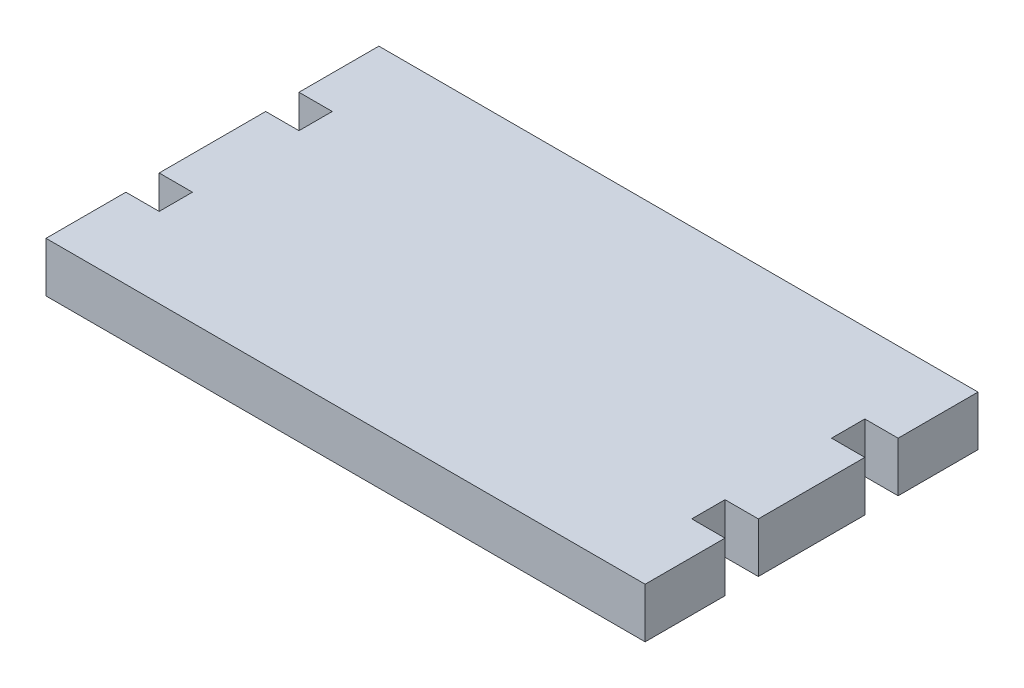
ISO-10303-21;
HEADER;
FILE_DESCRIPTION(('STEP AP214'),'2;1');
FILE_NAME('part.step','',(''),(''),'','','');
FILE_SCHEMA(('AUTOMOTIVE_DESIGN { 1 0 10303 214 1 1 1 1 }'));
ENDSEC;
DATA;
#1=APPLICATION_CONTEXT('core data for automotive mechanical design processes');
#2=APPLICATION_PROTOCOL_DEFINITION('international standard','automotive_design',2000,#1);
#3=PRODUCT_CONTEXT('',#1,'mechanical');
#4=PRODUCT('Part','Part','',(#3));
#5=PRODUCT_RELATED_PRODUCT_CATEGORY('part','',(#4));
#6=PRODUCT_DEFINITION_FORMATION('','',#4);
#7=PRODUCT_DEFINITION_CONTEXT('part definition',#1,'design');
#8=PRODUCT_DEFINITION('design','',#6,#7);
#9=PRODUCT_DEFINITION_SHAPE('','',#8);
#10=(LENGTH_UNIT() NAMED_UNIT(*) SI_UNIT(.MILLI.,.METRE.));
#11=(NAMED_UNIT(*) PLANE_ANGLE_UNIT() SI_UNIT($,.RADIAN.));
#12=(NAMED_UNIT(*) SI_UNIT($,.STERADIAN.) SOLID_ANGLE_UNIT());
#13=UNCERTAINTY_MEASURE_WITH_UNIT(LENGTH_MEASURE(1.E-05),#10,'distance_accuracy_value','');
#14=(GEOMETRIC_REPRESENTATION_CONTEXT(3) GLOBAL_UNCERTAINTY_ASSIGNED_CONTEXT((#13)) GLOBAL_UNIT_ASSIGNED_CONTEXT((#10,
#11,#12)) REPRESENTATION_CONTEXT('',''));
#15=CARTESIAN_POINT('',(0.,0.,0.));
#16=DIRECTION('',(0.,0.,1.));
#17=DIRECTION('',(1.,0.,0.));
#18=AXIS2_PLACEMENT_3D('',#15,#16,#17);
#19=CARTESIAN_POINT('',(0.,4.7625,0.));
#20=DIRECTION('',(-1.,0.,0.));
#21=DIRECTION('',(0.,0.,1.));
#22=AXIS2_PLACEMENT_3D('',#19,#20,#21);
#23=PLANE('',#22);
#24=DIRECTION('',(0.,0.,-1.));
#25=VECTOR('',#24,1.);
#26=CARTESIAN_POINT('',(0.,0.,0.));
#27=LINE('',#26,#25);
#28=CARTESIAN_POINT('',(0.,0.,-24.13));
#29=VERTEX_POINT('',#28);
#30=CARTESIAN_POINT('',(0.,0.,-31.75));
#31=VERTEX_POINT('',#30);
#32=EDGE_CURVE('E210',#29,#31,#27,.T.);
#33=ORIENTED_EDGE('',*,*,#32,.F.);
#34=DIRECTION('',(0.,-1.,0.));
#35=VECTOR('',#34,1.);
#36=CARTESIAN_POINT('',(0.,4.7625,-24.13));
#37=LINE('',#36,#35);
#38=CARTESIAN_POINT('',(0.,4.7625,-24.13));
#39=VERTEX_POINT('',#38);
#40=EDGE_CURVE('E11',#39,#29,#37,.T.);
#41=ORIENTED_EDGE('',*,*,#40,.F.);
#42=DIRECTION('',(0.,0.,-1.));
#43=VECTOR('',#42,1.);
#44=CARTESIAN_POINT('',(0.,4.7625,0.));
#45=LINE('',#44,#43);
#46=CARTESIAN_POINT('',(0.,4.7625,-31.75));
#47=VERTEX_POINT('',#46);
#48=EDGE_CURVE('E278',#39,#47,#45,.T.);
#49=ORIENTED_EDGE('',*,*,#48,.T.);
#50=DIRECTION('',(0.,-1.,0.));
#51=VECTOR('',#50,1.);
#52=CARTESIAN_POINT('',(0.,4.7625,-31.75));
#53=LINE('',#52,#51);
#54=EDGE_CURVE('E56',#47,#31,#53,.T.);
#55=ORIENTED_EDGE('',*,*,#54,.T.);
#56=EDGE_LOOP('',(#33,#41,#49,#55));
#57=FACE_BOUND('',#56,.T.);
#58=ADVANCED_FACE('F39',(#57),#23,.T.);
#59=CARTESIAN_POINT('',(0.,4.7625,-24.13));
#60=DIRECTION('',(0.,0.,-1.));
#61=DIRECTION('',(-1.,0.,0.));
#62=AXIS2_PLACEMENT_3D('',#59,#60,#61);
#63=PLANE('',#62);
#64=DIRECTION('',(1.,0.,0.));
#65=VECTOR('',#64,1.);
#66=CARTESIAN_POINT('',(0.,0.,-24.13));
#67=LINE('',#66,#65);
#68=CARTESIAN_POINT('',(3.175,0.,-24.13));
#69=VERTEX_POINT('',#68);
#70=EDGE_CURVE('E213',#29,#69,#67,.T.);
#71=ORIENTED_EDGE('',*,*,#70,.T.);
#72=DIRECTION('',(0.,-1.,0.));
#73=VECTOR('',#72,1.);
#74=CARTESIAN_POINT('',(3.175,4.7625,-24.13));
#75=LINE('',#74,#73);
#76=CARTESIAN_POINT('',(3.175,4.7625,-24.13));
#77=VERTEX_POINT('',#76);
#78=EDGE_CURVE('E48',#77,#69,#75,.T.);
#79=ORIENTED_EDGE('',*,*,#78,.F.);
#80=DIRECTION('',(1.,0.,0.));
#81=VECTOR('',#80,1.);
#82=CARTESIAN_POINT('',(0.,4.7625,-24.13));
#83=LINE('',#82,#81);
#84=EDGE_CURVE('E633',#39,#77,#83,.T.);
#85=ORIENTED_EDGE('',*,*,#84,.F.);
#86=ORIENTED_EDGE('',*,*,#40,.T.);
#87=EDGE_LOOP('',(#71,#79,#85,#86));
#88=FACE_BOUND('',#87,.T.);
#89=ADVANCED_FACE('F418',(#88),#63,.F.);
#90=CARTESIAN_POINT('',(3.17500000000003,4.7625,0.));
#91=DIRECTION('',(1.,0.,0.));
#92=DIRECTION('',(0.,0.,-1.));
#93=AXIS2_PLACEMENT_3D('',#90,#91,#92);
#94=PLANE('',#93);
#95=DIRECTION('',(0.,0.,1.));
#96=VECTOR('',#95,1.);
#97=CARTESIAN_POINT('',(3.17500000000003,0.,0.));
#98=LINE('',#97,#96);
#99=CARTESIAN_POINT('',(3.175,0.,-20.955));
#100=VERTEX_POINT('',#99);
#101=EDGE_CURVE('E216',#69,#100,#98,.T.);
#102=ORIENTED_EDGE('',*,*,#101,.T.);
#103=DIRECTION('',(0.,-1.,0.));
#104=VECTOR('',#103,1.);
#105=CARTESIAN_POINT('',(3.175,4.7625,-20.955));
#106=LINE('',#105,#104);
#107=CARTESIAN_POINT('',(3.175,4.7625,-20.955));
#108=VERTEX_POINT('',#107);
#109=EDGE_CURVE('E330',#108,#100,#106,.T.);
#110=ORIENTED_EDGE('',*,*,#109,.F.);
#111=DIRECTION('',(0.,0.,1.));
#112=VECTOR('',#111,1.);
#113=CARTESIAN_POINT('',(3.17500000000003,4.7625,0.));
#114=LINE('',#113,#112);
#115=EDGE_CURVE('E341',#77,#108,#114,.T.);
#116=ORIENTED_EDGE('',*,*,#115,.F.);
#117=ORIENTED_EDGE('',*,*,#78,.T.);
#118=EDGE_LOOP('',(#102,#110,#116,#117));
#119=FACE_BOUND('',#118,.T.);
#120=ADVANCED_FACE('F339',(#119),#94,.F.);
#121=CARTESIAN_POINT('',(0.,4.7625,-20.955));
#122=DIRECTION('',(0.,0.,1.));
#123=DIRECTION('',(1.,0.,0.));
#124=AXIS2_PLACEMENT_3D('',#121,#122,#123);
#125=PLANE('',#124);
#126=DIRECTION('',(-1.,0.,0.));
#127=VECTOR('',#126,1.);
#128=CARTESIAN_POINT('',(0.,0.,-20.955));
#129=LINE('',#128,#127);
#130=CARTESIAN_POINT('',(0.,0.,-20.955));
#131=VERTEX_POINT('',#130);
#132=EDGE_CURVE('E219',#100,#131,#129,.T.);
#133=ORIENTED_EDGE('',*,*,#132,.T.);
#134=DIRECTION('',(0.,-1.,0.));
#135=VECTOR('',#134,1.);
#136=CARTESIAN_POINT('',(0.,4.7625,-20.955));
#137=LINE('',#136,#135);
#138=CARTESIAN_POINT('',(0.,4.7625,-20.955));
#139=VERTEX_POINT('',#138);
#140=EDGE_CURVE('E326',#139,#131,#137,.T.);
#141=ORIENTED_EDGE('',*,*,#140,.F.);
#142=DIRECTION('',(-1.,0.,0.));
#143=VECTOR('',#142,1.);
#144=CARTESIAN_POINT('',(0.,4.7625,-20.955));
#145=LINE('',#144,#143);
#146=EDGE_CURVE('E361',#108,#139,#145,.T.);
#147=ORIENTED_EDGE('',*,*,#146,.F.);
#148=ORIENTED_EDGE('',*,*,#109,.T.);
#149=EDGE_LOOP('',(#133,#141,#147,#148));
#150=FACE_BOUND('',#149,.T.);
#151=ADVANCED_FACE('F351',(#150),#125,.F.);
#152=CARTESIAN_POINT('',(0.,4.7625,0.));
#153=DIRECTION('',(1.,0.,0.));
#154=DIRECTION('',(0.,0.,-1.));
#155=AXIS2_PLACEMENT_3D('',#152,#153,#154);
#156=PLANE('',#155);
#157=DIRECTION('',(0.,0.,1.));
#158=VECTOR('',#157,1.);
#159=CARTESIAN_POINT('',(0.,0.,0.));
#160=LINE('',#159,#158);
#161=CARTESIAN_POINT('',(0.,0.,-10.795));
#162=VERTEX_POINT('',#161);
#163=EDGE_CURVE('E222',#131,#162,#160,.T.);
#164=ORIENTED_EDGE('',*,*,#163,.T.);
#165=DIRECTION('',(0.,-1.,0.));
#166=VECTOR('',#165,1.);
#167=CARTESIAN_POINT('',(0.,4.7625,-10.795));
#168=LINE('',#167,#166);
#169=CARTESIAN_POINT('',(0.,4.7625,-10.795));
#170=VERTEX_POINT('',#169);
#171=EDGE_CURVE('E322',#170,#162,#168,.T.);
#172=ORIENTED_EDGE('',*,*,#171,.F.);
#173=DIRECTION('',(0.,0.,1.));
#174=VECTOR('',#173,1.);
#175=CARTESIAN_POINT('',(0.,4.7625,0.));
#176=LINE('',#175,#174);
#177=EDGE_CURVE('E357',#139,#170,#176,.T.);
#178=ORIENTED_EDGE('',*,*,#177,.F.);
#179=ORIENTED_EDGE('',*,*,#140,.T.);
#180=EDGE_LOOP('',(#164,#172,#178,#179));
#181=FACE_BOUND('',#180,.T.);
#182=ADVANCED_FACE('F355',(#181),#156,.F.);
#183=CARTESIAN_POINT('',(0.,4.7625,-10.795));
#184=DIRECTION('',(0.,0.,-1.));
#185=DIRECTION('',(-1.,0.,0.));
#186=AXIS2_PLACEMENT_3D('',#183,#184,#185);
#187=PLANE('',#186);
#188=DIRECTION('',(1.,0.,0.));
#189=VECTOR('',#188,1.);
#190=CARTESIAN_POINT('',(0.,0.,-10.795));
#191=LINE('',#190,#189);
#192=CARTESIAN_POINT('',(3.175,0.,-10.795));
#193=VERTEX_POINT('',#192);
#194=EDGE_CURVE('E225',#162,#193,#191,.T.);
#195=ORIENTED_EDGE('',*,*,#194,.T.);
#196=DIRECTION('',(0.,-1.,0.));
#197=VECTOR('',#196,1.);
#198=CARTESIAN_POINT('',(3.175,4.7625,-10.795));
#199=LINE('',#198,#197);
#200=CARTESIAN_POINT('',(3.175,4.7625,-10.795));
#201=VERTEX_POINT('',#200);
#202=EDGE_CURVE('E318',#201,#193,#199,.T.);
#203=ORIENTED_EDGE('',*,*,#202,.F.);
#204=DIRECTION('',(1.,0.,0.));
#205=VECTOR('',#204,1.);
#206=CARTESIAN_POINT('',(0.,4.7625,-10.795));
#207=LINE('',#206,#205);
#208=EDGE_CURVE('E360',#170,#201,#207,.T.);
#209=ORIENTED_EDGE('',*,*,#208,.F.);
#210=ORIENTED_EDGE('',*,*,#171,.T.);
#211=EDGE_LOOP('',(#195,#203,#209,#210));
#212=FACE_BOUND('',#211,.T.);
#213=ADVANCED_FACE('F431',(#212),#187,.F.);
#214=CARTESIAN_POINT('',(3.17499999999998,4.7625,0.));
#215=DIRECTION('',(1.,0.,0.));
#216=DIRECTION('',(0.,0.,-1.));
#217=AXIS2_PLACEMENT_3D('',#214,#215,#216);
#218=PLANE('',#217);
#219=DIRECTION('',(0.,0.,1.));
#220=VECTOR('',#219,1.);
#221=CARTESIAN_POINT('',(3.17499999999998,0.,0.));
#222=LINE('',#221,#220);
#223=CARTESIAN_POINT('',(3.175,0.,-7.62));
#224=VERTEX_POINT('',#223);
#225=EDGE_CURVE('E228',#193,#224,#222,.T.);
#226=ORIENTED_EDGE('',*,*,#225,.T.);
#227=DIRECTION('',(0.,-1.,0.));
#228=VECTOR('',#227,1.);
#229=CARTESIAN_POINT('',(3.175,4.7625,-7.62));
#230=LINE('',#229,#228);
#231=CARTESIAN_POINT('',(3.175,4.7625,-7.62));
#232=VERTEX_POINT('',#231);
#233=EDGE_CURVE('E314',#232,#224,#230,.T.);
#234=ORIENTED_EDGE('',*,*,#233,.F.);
#235=DIRECTION('',(0.,0.,1.));
#236=VECTOR('',#235,1.);
#237=CARTESIAN_POINT('',(3.17499999999998,4.7625,0.));
#238=LINE('',#237,#236);
#239=EDGE_CURVE('E365',#201,#232,#238,.T.);
#240=ORIENTED_EDGE('',*,*,#239,.F.);
#241=ORIENTED_EDGE('',*,*,#202,.T.);
#242=EDGE_LOOP('',(#226,#234,#240,#241));
#243=FACE_BOUND('',#242,.T.);
#244=ADVANCED_FACE('F434',(#243),#218,.F.);
#245=CARTESIAN_POINT('',(0.,4.7625,-7.62));
#246=DIRECTION('',(0.,0.,1.));
#247=DIRECTION('',(1.,0.,0.));
#248=AXIS2_PLACEMENT_3D('',#245,#246,#247);
#249=PLANE('',#248);
#250=DIRECTION('',(-1.,0.,0.));
#251=VECTOR('',#250,1.);
#252=CARTESIAN_POINT('',(0.,0.,-7.62));
#253=LINE('',#252,#251);
#254=CARTESIAN_POINT('',(0.,0.,-7.62));
#255=VERTEX_POINT('',#254);
#256=EDGE_CURVE('E231',#224,#255,#253,.T.);
#257=ORIENTED_EDGE('',*,*,#256,.T.);
#258=DIRECTION('',(0.,-1.,0.));
#259=VECTOR('',#258,1.);
#260=CARTESIAN_POINT('',(0.,4.7625,-7.62));
#261=LINE('',#260,#259);
#262=CARTESIAN_POINT('',(0.,4.7625,-7.62));
#263=VERTEX_POINT('',#262);
#264=EDGE_CURVE('E311',#263,#255,#261,.T.);
#265=ORIENTED_EDGE('',*,*,#264,.F.);
#266=DIRECTION('',(-1.,0.,0.));
#267=VECTOR('',#266,1.);
#268=CARTESIAN_POINT('',(0.,4.7625,-7.62));
#269=LINE('',#268,#267);
#270=EDGE_CURVE('E372',#232,#263,#269,.T.);
#271=ORIENTED_EDGE('',*,*,#270,.F.);
#272=ORIENTED_EDGE('',*,*,#233,.T.);
#273=EDGE_LOOP('',(#257,#265,#271,#272));
#274=FACE_BOUND('',#273,.T.);
#275=ADVANCED_FACE('F438',(#274),#249,.F.);
#276=CARTESIAN_POINT('',(0.,4.7625,0.));
#277=DIRECTION('',(-1.,0.,0.));
#278=DIRECTION('',(0.,0.,1.));
#279=AXIS2_PLACEMENT_3D('',#276,#277,#278);
#280=PLANE('',#279);
#281=DIRECTION('',(0.,0.,-1.));
#282=VECTOR('',#281,1.);
#283=CARTESIAN_POINT('',(0.,0.,0.));
#284=LINE('',#283,#282);
#285=CARTESIAN_POINT('',(0.,0.,0.));
#286=VERTEX_POINT('',#285);
#287=EDGE_CURVE('E235',#286,#255,#284,.T.);
#288=ORIENTED_EDGE('',*,*,#287,.F.);
#289=DIRECTION('',(0.,-1.,0.));
#290=VECTOR('',#289,1.);
#291=CARTESIAN_POINT('',(0.,4.7625,0.));
#292=LINE('',#291,#290);
#293=CARTESIAN_POINT('',(0.,4.7625,0.));
#294=VERTEX_POINT('',#293);
#295=EDGE_CURVE('E308',#294,#286,#292,.T.);
#296=ORIENTED_EDGE('',*,*,#295,.F.);
#297=DIRECTION('',(0.,0.,-1.));
#298=VECTOR('',#297,1.);
#299=CARTESIAN_POINT('',(0.,4.7625,0.));
#300=LINE('',#299,#298);
#301=EDGE_CURVE('E375',#294,#263,#300,.T.);
#302=ORIENTED_EDGE('',*,*,#301,.T.);
#303=ORIENTED_EDGE('',*,*,#264,.T.);
#304=EDGE_LOOP('',(#288,#296,#302,#303));
#305=FACE_BOUND('',#304,.T.);
#306=ADVANCED_FACE('F442',(#305),#280,.T.);
#307=CARTESIAN_POINT('',(0.,4.7625,0.));
#308=DIRECTION('',(0.,0.,-1.));
#309=DIRECTION('',(-1.,0.,0.));
#310=AXIS2_PLACEMENT_3D('',#307,#308,#309);
#311=PLANE('',#310);
#312=DIRECTION('',(1.,0.,0.));
#313=VECTOR('',#312,1.);
#314=CARTESIAN_POINT('',(0.,0.,0.));
#315=LINE('',#314,#313);
#316=CARTESIAN_POINT('',(57.15,0.,0.));
#317=VERTEX_POINT('',#316);
#318=EDGE_CURVE('E239',#286,#317,#315,.T.);
#319=ORIENTED_EDGE('',*,*,#318,.T.);
#320=DIRECTION('',(0.,-1.,0.));
#321=VECTOR('',#320,1.);
#322=CARTESIAN_POINT('',(57.15,4.7625,0.));
#323=LINE('',#322,#321);
#324=CARTESIAN_POINT('',(57.15,4.7625,0.));
#325=VERTEX_POINT('',#324);
#326=EDGE_CURVE('E305',#325,#317,#323,.T.);
#327=ORIENTED_EDGE('',*,*,#326,.F.);
#328=DIRECTION('',(1.,0.,0.));
#329=VECTOR('',#328,1.);
#330=CARTESIAN_POINT('',(0.,4.7625,0.));
#331=LINE('',#330,#329);
#332=EDGE_CURVE('E379',#294,#325,#331,.T.);
#333=ORIENTED_EDGE('',*,*,#332,.F.);
#334=ORIENTED_EDGE('',*,*,#295,.T.);
#335=EDGE_LOOP('',(#319,#327,#333,#334));
#336=FACE_BOUND('',#335,.T.);
#337=ADVANCED_FACE('F446',(#336),#311,.F.);
#338=CARTESIAN_POINT('',(57.15,4.7625,0.));
#339=DIRECTION('',(1.,0.,0.));
#340=DIRECTION('',(0.,0.,-1.));
#341=AXIS2_PLACEMENT_3D('',#338,#339,#340);
#342=PLANE('',#341);
#343=DIRECTION('',(0.,0.,1.));
#344=VECTOR('',#343,1.);
#345=CARTESIAN_POINT('',(57.15,0.,0.));
#346=LINE('',#345,#344);
#347=CARTESIAN_POINT('',(57.15,0.,-7.62000000000001));
#348=VERTEX_POINT('',#347);
#349=EDGE_CURVE('E243',#348,#317,#346,.T.);
#350=ORIENTED_EDGE('',*,*,#349,.F.);
#351=DIRECTION('',(0.,-1.,0.));
#352=VECTOR('',#351,1.);
#353=CARTESIAN_POINT('',(57.15,4.7625,-7.62000000000001));
#354=LINE('',#353,#352);
#355=CARTESIAN_POINT('',(57.15,4.7625,-7.62000000000001));
#356=VERTEX_POINT('',#355);
#357=EDGE_CURVE('E302',#356,#348,#354,.T.);
#358=ORIENTED_EDGE('',*,*,#357,.F.);
#359=DIRECTION('',(0.,0.,1.));
#360=VECTOR('',#359,1.);
#361=CARTESIAN_POINT('',(57.15,4.7625,0.));
#362=LINE('',#361,#360);
#363=EDGE_CURVE('E382',#356,#325,#362,.T.);
#364=ORIENTED_EDGE('',*,*,#363,.T.);
#365=ORIENTED_EDGE('',*,*,#326,.T.);
#366=EDGE_LOOP('',(#350,#358,#364,#365));
#367=FACE_BOUND('',#366,.T.);
#368=ADVANCED_FACE('F450',(#367),#342,.T.);
#369=CARTESIAN_POINT('',(0.,4.7625,-7.62000000000001));
#370=DIRECTION('',(0.,0.,1.));
#371=DIRECTION('',(1.,0.,0.));
#372=AXIS2_PLACEMENT_3D('',#369,#370,#371);
#373=PLANE('',#372);
#374=DIRECTION('',(-1.,0.,0.));
#375=VECTOR('',#374,1.);
#376=CARTESIAN_POINT('',(0.,0.,-7.62000000000001));
#377=LINE('',#376,#375);
#378=CARTESIAN_POINT('',(53.975,0.,-7.62000000000001));
#379=VERTEX_POINT('',#378);
#380=EDGE_CURVE('E247',#348,#379,#377,.T.);
#381=ORIENTED_EDGE('',*,*,#380,.T.);
#382=DIRECTION('',(0.,-1.,0.));
#383=VECTOR('',#382,1.);
#384=CARTESIAN_POINT('',(53.975,4.7625,-7.62000000000001));
#385=LINE('',#384,#383);
#386=CARTESIAN_POINT('',(53.975,4.7625,-7.62000000000001));
#387=VERTEX_POINT('',#386);
#388=EDGE_CURVE('E298',#387,#379,#385,.T.);
#389=ORIENTED_EDGE('',*,*,#388,.F.);
#390=DIRECTION('',(-1.,0.,0.));
#391=VECTOR('',#390,1.);
#392=CARTESIAN_POINT('',(0.,4.7625,-7.62000000000001));
#393=LINE('',#392,#391);
#394=EDGE_CURVE('E386',#356,#387,#393,.T.);
#395=ORIENTED_EDGE('',*,*,#394,.F.);
#396=ORIENTED_EDGE('',*,*,#357,.T.);
#397=EDGE_LOOP('',(#381,#389,#395,#396));
#398=FACE_BOUND('',#397,.T.);
#399=ADVANCED_FACE('F454',(#398),#373,.F.);
#400=CARTESIAN_POINT('',(53.975,4.7625,0.));
#401=DIRECTION('',(-1.,0.,0.));
#402=DIRECTION('',(0.,0.,1.));
#403=AXIS2_PLACEMENT_3D('',#400,#401,#402);
#404=PLANE('',#403);
#405=DIRECTION('',(0.,0.,-1.));
#406=VECTOR('',#405,1.);
#407=CARTESIAN_POINT('',(53.975,0.,0.));
#408=LINE('',#407,#406);
#409=CARTESIAN_POINT('',(53.975,0.,-10.795));
#410=VERTEX_POINT('',#409);
#411=EDGE_CURVE('E250',#379,#410,#408,.T.);
#412=ORIENTED_EDGE('',*,*,#411,.T.);
#413=DIRECTION('',(0.,-1.,0.));
#414=VECTOR('',#413,1.);
#415=CARTESIAN_POINT('',(53.975,4.7625,-10.795));
#416=LINE('',#415,#414);
#417=CARTESIAN_POINT('',(53.975,4.7625,-10.795));
#418=VERTEX_POINT('',#417);
#419=EDGE_CURVE('E294',#418,#410,#416,.T.);
#420=ORIENTED_EDGE('',*,*,#419,.F.);
#421=DIRECTION('',(0.,0.,-1.));
#422=VECTOR('',#421,1.);
#423=CARTESIAN_POINT('',(53.975,4.7625,0.));
#424=LINE('',#423,#422);
#425=EDGE_CURVE('E389',#387,#418,#424,.T.);
#426=ORIENTED_EDGE('',*,*,#425,.F.);
#427=ORIENTED_EDGE('',*,*,#388,.T.);
#428=EDGE_LOOP('',(#412,#420,#426,#427));
#429=FACE_BOUND('',#428,.T.);
#430=ADVANCED_FACE('F458',(#429),#404,.F.);
#431=CARTESIAN_POINT('',(0.,4.7625,-10.795));
#432=DIRECTION('',(0.,0.,-1.));
#433=DIRECTION('',(-1.,0.,0.));
#434=AXIS2_PLACEMENT_3D('',#431,#432,#433);
#435=PLANE('',#434);
#436=DIRECTION('',(1.,0.,0.));
#437=VECTOR('',#436,1.);
#438=CARTESIAN_POINT('',(0.,0.,-10.795));
#439=LINE('',#438,#437);
#440=CARTESIAN_POINT('',(57.15,0.,-10.795));
#441=VERTEX_POINT('',#440);
#442=EDGE_CURVE('E253',#410,#441,#439,.T.);
#443=ORIENTED_EDGE('',*,*,#442,.T.);
#444=DIRECTION('',(0.,-1.,0.));
#445=VECTOR('',#444,1.);
#446=CARTESIAN_POINT('',(57.15,4.7625,-10.795));
#447=LINE('',#446,#445);
#448=CARTESIAN_POINT('',(57.15,4.7625,-10.795));
#449=VERTEX_POINT('',#448);
#450=EDGE_CURVE('E291',#449,#441,#447,.T.);
#451=ORIENTED_EDGE('',*,*,#450,.F.);
#452=DIRECTION('',(1.,0.,0.));
#453=VECTOR('',#452,1.);
#454=CARTESIAN_POINT('',(0.,4.7625,-10.795));
#455=LINE('',#454,#453);
#456=EDGE_CURVE('E392',#418,#449,#455,.T.);
#457=ORIENTED_EDGE('',*,*,#456,.F.);
#458=ORIENTED_EDGE('',*,*,#419,.T.);
#459=EDGE_LOOP('',(#443,#451,#457,#458));
#460=FACE_BOUND('',#459,.T.);
#461=ADVANCED_FACE('F462',(#460),#435,.F.);
#462=CARTESIAN_POINT('',(57.15,4.7625,0.));
#463=DIRECTION('',(1.,0.,0.));
#464=DIRECTION('',(0.,0.,-1.));
#465=AXIS2_PLACEMENT_3D('',#462,#463,#464);
#466=PLANE('',#465);
#467=DIRECTION('',(0.,0.,1.));
#468=VECTOR('',#467,1.);
#469=CARTESIAN_POINT('',(57.15,0.,0.));
#470=LINE('',#469,#468);
#471=CARTESIAN_POINT('',(57.15,0.,-20.955));
#472=VERTEX_POINT('',#471);
#473=EDGE_CURVE('E257',#472,#441,#470,.T.);
#474=ORIENTED_EDGE('',*,*,#473,.F.);
#475=DIRECTION('',(0.,-1.,0.));
#476=VECTOR('',#475,1.);
#477=CARTESIAN_POINT('',(57.15,4.7625,-20.955));
#478=LINE('',#477,#476);
#479=CARTESIAN_POINT('',(57.15,4.7625,-20.955));
#480=VERTEX_POINT('',#479);
#481=EDGE_CURVE('E288',#480,#472,#478,.T.);
#482=ORIENTED_EDGE('',*,*,#481,.F.);
#483=DIRECTION('',(0.,0.,1.));
#484=VECTOR('',#483,1.);
#485=CARTESIAN_POINT('',(57.15,4.7625,0.));
#486=LINE('',#485,#484);
#487=EDGE_CURVE('E395',#480,#449,#486,.T.);
#488=ORIENTED_EDGE('',*,*,#487,.T.);
#489=ORIENTED_EDGE('',*,*,#450,.T.);
#490=EDGE_LOOP('',(#474,#482,#488,#489));
#491=FACE_BOUND('',#490,.T.);
#492=ADVANCED_FACE('F466',(#491),#466,.T.);
#493=CARTESIAN_POINT('',(0.,4.7625,-20.9549999999999));
#494=DIRECTION('',(0.,0.,-1.));
#495=DIRECTION('',(-1.,0.,0.));
#496=AXIS2_PLACEMENT_3D('',#493,#494,#495);
#497=PLANE('',#496);
#498=DIRECTION('',(1.,0.,0.));
#499=VECTOR('',#498,1.);
#500=CARTESIAN_POINT('',(0.,0.,-20.9549999999999));
#501=LINE('',#500,#499);
#502=CARTESIAN_POINT('',(53.975,0.,-20.955));
#503=VERTEX_POINT('',#502);
#504=EDGE_CURVE('E261',#503,#472,#501,.T.);
#505=ORIENTED_EDGE('',*,*,#504,.F.);
#506=DIRECTION('',(0.,-1.,0.));
#507=VECTOR('',#506,1.);
#508=CARTESIAN_POINT('',(53.975,4.7625,-20.955));
#509=LINE('',#508,#507);
#510=CARTESIAN_POINT('',(53.975,4.7625,-20.955));
#511=VERTEX_POINT('',#510);
#512=EDGE_CURVE('E285',#511,#503,#509,.T.);
#513=ORIENTED_EDGE('',*,*,#512,.F.);
#514=DIRECTION('',(1.,0.,0.));
#515=VECTOR('',#514,1.);
#516=CARTESIAN_POINT('',(0.,4.7625,-20.9549999999999));
#517=LINE('',#516,#515);
#518=EDGE_CURVE('E399',#511,#480,#517,.T.);
#519=ORIENTED_EDGE('',*,*,#518,.T.);
#520=ORIENTED_EDGE('',*,*,#481,.T.);
#521=EDGE_LOOP('',(#505,#513,#519,#520));
#522=FACE_BOUND('',#521,.T.);
#523=ADVANCED_FACE('F470',(#522),#497,.T.);
#524=CARTESIAN_POINT('',(53.975,4.7625,0.));
#525=DIRECTION('',(1.,0.,0.));
#526=DIRECTION('',(0.,0.,-1.));
#527=AXIS2_PLACEMENT_3D('',#524,#525,#526);
#528=PLANE('',#527);
#529=DIRECTION('',(0.,0.,1.));
#530=VECTOR('',#529,1.);
#531=CARTESIAN_POINT('',(53.975,0.,0.));
#532=LINE('',#531,#530);
#533=CARTESIAN_POINT('',(53.975,0.,-24.13));
#534=VERTEX_POINT('',#533);
#535=EDGE_CURVE('E265',#534,#503,#532,.T.);
#536=ORIENTED_EDGE('',*,*,#535,.F.);
#537=DIRECTION('',(0.,-1.,0.));
#538=VECTOR('',#537,1.);
#539=CARTESIAN_POINT('',(53.975,4.7625,-24.13));
#540=LINE('',#539,#538);
#541=CARTESIAN_POINT('',(53.975,4.7625,-24.13));
#542=VERTEX_POINT('',#541);
#543=EDGE_CURVE('E188',#542,#534,#540,.T.);
#544=ORIENTED_EDGE('',*,*,#543,.F.);
#545=DIRECTION('',(0.,0.,1.));
#546=VECTOR('',#545,1.);
#547=CARTESIAN_POINT('',(53.975,4.7625,0.));
#548=LINE('',#547,#546);
#549=EDGE_CURVE('E199',#542,#511,#548,.T.);
#550=ORIENTED_EDGE('',*,*,#549,.T.);
#551=ORIENTED_EDGE('',*,*,#512,.T.);
#552=EDGE_LOOP('',(#536,#544,#550,#551));
#553=FACE_BOUND('',#552,.T.);
#554=ADVANCED_FACE('F405',(#553),#528,.T.);
#555=CARTESIAN_POINT('',(0.,4.7625,-24.13));
#556=DIRECTION('',(0.,0.,1.));
#557=DIRECTION('',(1.,0.,0.));
#558=AXIS2_PLACEMENT_3D('',#555,#556,#557);
#559=PLANE('',#558);
#560=DIRECTION('',(-1.,0.,0.));
#561=VECTOR('',#560,1.);
#562=CARTESIAN_POINT('',(0.,0.,-24.13));
#563=LINE('',#562,#561);
#564=CARTESIAN_POINT('',(57.15,0.,-24.13));
#565=VERTEX_POINT('',#564);
#566=EDGE_CURVE('E183',#565,#534,#563,.T.);
#567=ORIENTED_EDGE('',*,*,#566,.F.);
#568=DIRECTION('',(0.,-1.,0.));
#569=VECTOR('',#568,1.);
#570=CARTESIAN_POINT('',(57.15,4.7625,-24.13));
#571=LINE('',#570,#569);
#572=CARTESIAN_POINT('',(57.15,4.7625,-24.13));
#573=VERTEX_POINT('',#572);
#574=EDGE_CURVE('E178',#573,#565,#571,.T.);
#575=ORIENTED_EDGE('',*,*,#574,.F.);
#576=DIRECTION('',(-1.,0.,0.));
#577=VECTOR('',#576,1.);
#578=CARTESIAN_POINT('',(0.,4.7625,-24.13));
#579=LINE('',#578,#577);
#580=EDGE_CURVE('E181',#573,#542,#579,.T.);
#581=ORIENTED_EDGE('',*,*,#580,.T.);
#582=ORIENTED_EDGE('',*,*,#543,.T.);
#583=EDGE_LOOP('',(#567,#575,#581,#582));
#584=FACE_BOUND('',#583,.T.);
#585=ADVANCED_FACE('F180',(#584),#559,.T.);
#586=CARTESIAN_POINT('',(57.15,4.7625,0.));
#587=DIRECTION('',(1.,0.,0.));
#588=DIRECTION('',(0.,0.,-1.));
#589=AXIS2_PLACEMENT_3D('',#586,#587,#588);
#590=PLANE('',#589);
#591=DIRECTION('',(0.,0.,1.));
#592=VECTOR('',#591,1.);
#593=CARTESIAN_POINT('',(57.15,0.,0.));
#594=LINE('',#593,#592);
#595=CARTESIAN_POINT('',(57.15,0.,-31.75));
#596=VERTEX_POINT('',#595);
#597=EDGE_CURVE('E271',#596,#565,#594,.T.);
#598=ORIENTED_EDGE('',*,*,#597,.F.);
#599=DIRECTION('',(0.,-1.,0.));
#600=VECTOR('',#599,1.);
#601=CARTESIAN_POINT('',(57.15,4.7625,-31.75));
#602=LINE('',#601,#600);
#603=CARTESIAN_POINT('',(57.15,4.7625,-31.75));
#604=VERTEX_POINT('',#603);
#605=EDGE_CURVE('E117',#604,#596,#602,.T.);
#606=ORIENTED_EDGE('',*,*,#605,.F.);
#607=DIRECTION('',(0.,0.,1.));
#608=VECTOR('',#607,1.);
#609=CARTESIAN_POINT('',(57.15,4.7625,0.));
#610=LINE('',#609,#608);
#611=EDGE_CURVE('E196',#604,#573,#610,.T.);
#612=ORIENTED_EDGE('',*,*,#611,.T.);
#613=ORIENTED_EDGE('',*,*,#574,.T.);
#614=EDGE_LOOP('',(#598,#606,#612,#613));
#615=FACE_BOUND('',#614,.T.);
#616=ADVANCED_FACE('F202',(#615),#590,.T.);
#617=CARTESIAN_POINT('',(0.,4.7625,-31.75));
#618=DIRECTION('',(0.,0.,-1.));
#619=DIRECTION('',(-1.,0.,0.));
#620=AXIS2_PLACEMENT_3D('',#617,#618,#619);
#621=PLANE('',#620);
#622=DIRECTION('',(1.,0.,0.));
#623=VECTOR('',#622,1.);
#624=CARTESIAN_POINT('',(0.,0.,-31.75));
#625=LINE('',#624,#623);
#626=EDGE_CURVE('E274',#31,#596,#625,.T.);
#627=ORIENTED_EDGE('',*,*,#626,.F.);
#628=ORIENTED_EDGE('',*,*,#54,.F.);
#629=DIRECTION('',(1.,0.,0.));
#630=VECTOR('',#629,1.);
#631=CARTESIAN_POINT('',(0.,4.7625,-31.75));
#632=LINE('',#631,#630);
#633=EDGE_CURVE('E204',#47,#604,#632,.T.);
#634=ORIENTED_EDGE('',*,*,#633,.T.);
#635=ORIENTED_EDGE('',*,*,#605,.T.);
#636=EDGE_LOOP('',(#627,#628,#634,#635));
#637=FACE_BOUND('',#636,.T.);
#638=ADVANCED_FACE('F407',(#637),#621,.T.);
#639=CARTESIAN_POINT('',(0.,4.7625,0.));
#640=DIRECTION('',(0.,1.,0.));
#641=DIRECTION('',(0.,0.,1.));
#642=AXIS2_PLACEMENT_3D('',#639,#640,#641);
#643=PLANE('',#642);
#644=ORIENTED_EDGE('',*,*,#48,.F.);
#645=ORIENTED_EDGE('',*,*,#84,.T.);
#646=ORIENTED_EDGE('',*,*,#115,.T.);
#647=ORIENTED_EDGE('',*,*,#146,.T.);
#648=ORIENTED_EDGE('',*,*,#177,.T.);
#649=ORIENTED_EDGE('',*,*,#208,.T.);
#650=ORIENTED_EDGE('',*,*,#239,.T.);
#651=ORIENTED_EDGE('',*,*,#270,.T.);
#652=ORIENTED_EDGE('',*,*,#301,.F.);
#653=ORIENTED_EDGE('',*,*,#332,.T.);
#654=ORIENTED_EDGE('',*,*,#363,.F.);
#655=ORIENTED_EDGE('',*,*,#394,.T.);
#656=ORIENTED_EDGE('',*,*,#425,.T.);
#657=ORIENTED_EDGE('',*,*,#456,.T.);
#658=ORIENTED_EDGE('',*,*,#487,.F.);
#659=ORIENTED_EDGE('',*,*,#518,.F.);
#660=ORIENTED_EDGE('',*,*,#549,.F.);
#661=ORIENTED_EDGE('',*,*,#580,.F.);
#662=ORIENTED_EDGE('',*,*,#611,.F.);
#663=ORIENTED_EDGE('',*,*,#633,.F.);
#664=EDGE_LOOP('',(#644,#645,#646,#647,#648,#649,#650,#651,#652,#653,#654,#655,#656,#657,#658,
#659,#660,#661,#662,#663));
#665=FACE_BOUND('',#664,.T.);
#666=ADVANCED_FACE('F194',(#665),#643,.T.);
#667=CARTESIAN_POINT('',(0.,0.,0.));
#668=DIRECTION('',(0.,1.,0.));
#669=DIRECTION('',(0.,0.,1.));
#670=AXIS2_PLACEMENT_3D('',#667,#668,#669);
#671=PLANE('',#670);
#672=ORIENTED_EDGE('',*,*,#32,.T.);
#673=ORIENTED_EDGE('',*,*,#626,.T.);
#674=ORIENTED_EDGE('',*,*,#597,.T.);
#675=ORIENTED_EDGE('',*,*,#566,.T.);
#676=ORIENTED_EDGE('',*,*,#535,.T.);
#677=ORIENTED_EDGE('',*,*,#504,.T.);
#678=ORIENTED_EDGE('',*,*,#473,.T.);
#679=ORIENTED_EDGE('',*,*,#442,.F.);
#680=ORIENTED_EDGE('',*,*,#411,.F.);
#681=ORIENTED_EDGE('',*,*,#380,.F.);
#682=ORIENTED_EDGE('',*,*,#349,.T.);
#683=ORIENTED_EDGE('',*,*,#318,.F.);
#684=ORIENTED_EDGE('',*,*,#287,.T.);
#685=ORIENTED_EDGE('',*,*,#256,.F.);
#686=ORIENTED_EDGE('',*,*,#225,.F.);
#687=ORIENTED_EDGE('',*,*,#194,.F.);
#688=ORIENTED_EDGE('',*,*,#163,.F.);
#689=ORIENTED_EDGE('',*,*,#132,.F.);
#690=ORIENTED_EDGE('',*,*,#101,.F.);
#691=ORIENTED_EDGE('',*,*,#70,.F.);
#692=EDGE_LOOP('',(#672,#673,#674,#675,#676,#677,#678,#679,#680,#681,#682,#683,#684,#685,#686,
#687,#688,#689,#690,#691));
#693=FACE_BOUND('',#692,.T.);
#694=ADVANCED_FACE('F346',(#693),#671,.F.);
#695=CLOSED_SHELL('',(#58,#89,#120,#151,#182,#213,#244,#275,#306,#337,#368,#399,#430,#461,#492,
#523,#554,#585,#616,#638,#666,#694));
#696=MANIFOLD_SOLID_BREP('B2',#695);
#697=ADVANCED_BREP_SHAPE_REPRESENTATION('',(#18,#696),#14);
#698=SHAPE_DEFINITION_REPRESENTATION(#9,#697);
ENDSEC;
END-ISO-10303-21;
